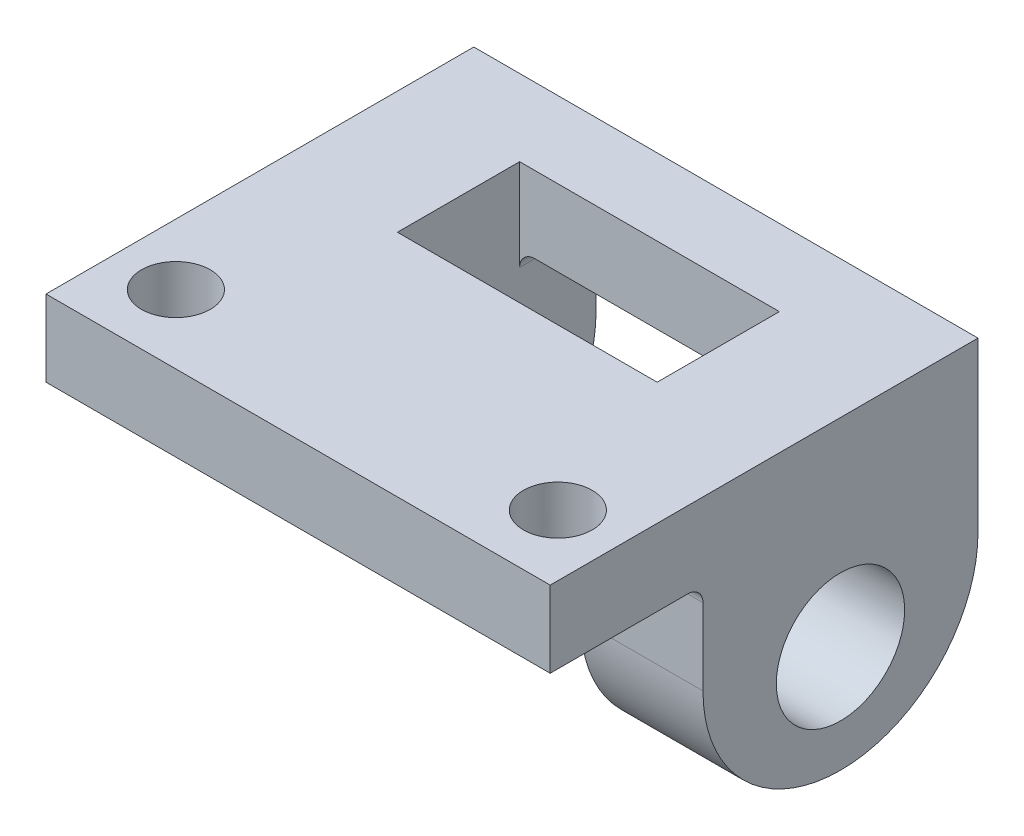
ISO-10303-21;
HEADER;
FILE_DESCRIPTION(('STEP AP214'),'2;1');
FILE_NAME('part.step','',(''),(''),'','','');
FILE_SCHEMA(('AUTOMOTIVE_DESIGN { 1 0 10303 214 1 1 1 1 }'));
ENDSEC;
DATA;
#1=APPLICATION_CONTEXT('core data for automotive mechanical design processes');
#2=APPLICATION_PROTOCOL_DEFINITION('international standard','automotive_design',2000,#1);
#3=PRODUCT_CONTEXT('',#1,'mechanical');
#4=PRODUCT('Part','Part','',(#3));
#5=PRODUCT_RELATED_PRODUCT_CATEGORY('part','',(#4));
#6=PRODUCT_DEFINITION_FORMATION('','',#4);
#7=PRODUCT_DEFINITION_CONTEXT('part definition',#1,'design');
#8=PRODUCT_DEFINITION('design','',#6,#7);
#9=PRODUCT_DEFINITION_SHAPE('','',#8);
#10=(LENGTH_UNIT() NAMED_UNIT(*) SI_UNIT(.MILLI.,.METRE.));
#11=(NAMED_UNIT(*) PLANE_ANGLE_UNIT() SI_UNIT($,.RADIAN.));
#12=(NAMED_UNIT(*) SI_UNIT($,.STERADIAN.) SOLID_ANGLE_UNIT());
#13=UNCERTAINTY_MEASURE_WITH_UNIT(LENGTH_MEASURE(1.E-05),#10,'distance_accuracy_value','');
#14=(GEOMETRIC_REPRESENTATION_CONTEXT(3) GLOBAL_UNCERTAINTY_ASSIGNED_CONTEXT((#13)) GLOBAL_UNIT_ASSIGNED_CONTEXT((#10,
#11,#12)) REPRESENTATION_CONTEXT('',''));
#15=CARTESIAN_POINT('',(0.,0.,0.));
#16=DIRECTION('',(0.,0.,1.));
#17=DIRECTION('',(1.,0.,0.));
#18=AXIS2_PLACEMENT_3D('',#15,#16,#17);
#19=CARTESIAN_POINT('',(0.,0.,0.));
#20=DIRECTION('',(0.,1.,0.));
#21=DIRECTION('',(0.,0.,1.));
#22=AXIS2_PLACEMENT_3D('',#19,#20,#21);
#23=PLANE('',#22);
#24=CARTESIAN_POINT('',(-12.5,0.,14.5));
#25=DIRECTION('',(0.,-1.,0.));
#26=DIRECTION('',(0.,0.,-1.));
#27=AXIS2_PLACEMENT_3D('',#24,#25,#26);
#28=CIRCLE('',#27,2.25);
#29=CARTESIAN_POINT('',(-12.5,0.,12.25));
#30=VERTEX_POINT('',#29);
#31=EDGE_CURVE('E337',#30,#30,#28,.T.);
#32=ORIENTED_EDGE('',*,*,#31,.F.);
#33=EDGE_LOOP('',(#32));
#34=FACE_BOUND('',#33,.T.);
#35=CARTESIAN_POINT('',(12.5,0.,14.5));
#36=DIRECTION('',(0.,-1.,0.));
#37=DIRECTION('',(0.,0.,-1.));
#38=AXIS2_PLACEMENT_3D('',#35,#36,#37);
#39=CIRCLE('',#38,2.25);
#40=CARTESIAN_POINT('',(12.5,0.,12.25));
#41=VERTEX_POINT('',#40);
#42=EDGE_CURVE('E342',#41,#41,#39,.T.);
#43=ORIENTED_EDGE('',*,*,#42,.F.);
#44=EDGE_LOOP('',(#43));
#45=FACE_BOUND('',#44,.T.);
#46=DIRECTION('',(0.,0.,1.));
#47=VECTOR('',#46,1.);
#48=CARTESIAN_POINT('',(-16.5,0.,-9.));
#49=LINE('',#48,#47);
#50=CARTESIAN_POINT('',(-16.5,0.,9.99999999999999));
#51=VERTEX_POINT('',#50);
#52=CARTESIAN_POINT('',(-16.5,0.,19.));
#53=VERTEX_POINT('',#52);
#54=EDGE_CURVE('E202',#51,#53,#49,.T.);
#55=ORIENTED_EDGE('',*,*,#54,.F.);
#56=DIRECTION('',(-1.,0.,0.));
#57=VECTOR('',#56,1.);
#58=CARTESIAN_POINT('',(-8.5,0.,10.));
#59=LINE('',#58,#57);
#60=CARTESIAN_POINT('',(-7.5,0.,10.));
#61=VERTEX_POINT('',#60);
#62=EDGE_CURVE('E58',#51,#61,#59,.F.);
#63=ORIENTED_EDGE('',*,*,#62,.T.);
#64=DIRECTION('',(0.,0.,1.));
#65=VECTOR('',#64,1.);
#66=CARTESIAN_POINT('',(-7.5,0.,0.));
#67=LINE('',#66,#65);
#68=CARTESIAN_POINT('',(-7.5,0.,4.));
#69=VERTEX_POINT('',#68);
#70=EDGE_CURVE('E313',#61,#69,#67,.F.);
#71=ORIENTED_EDGE('',*,*,#70,.T.);
#72=DIRECTION('',(1.,0.,0.));
#73=VECTOR('',#72,1.);
#74=CARTESIAN_POINT('',(-8.5,0.,4.));
#75=LINE('',#74,#73);
#76=CARTESIAN_POINT('',(7.50000000000001,0.,4.));
#77=VERTEX_POINT('',#76);
#78=EDGE_CURVE('E215',#69,#77,#75,.T.);
#79=ORIENTED_EDGE('',*,*,#78,.T.);
#80=DIRECTION('',(0.,0.,-1.));
#81=VECTOR('',#80,1.);
#82=CARTESIAN_POINT('',(7.5,0.,0.));
#83=LINE('',#82,#81);
#84=CARTESIAN_POINT('',(7.50000000000001,0.,10.));
#85=VERTEX_POINT('',#84);
#86=EDGE_CURVE('E311',#77,#85,#83,.F.);
#87=ORIENTED_EDGE('',*,*,#86,.T.);
#88=DIRECTION('',(-1.,0.,0.));
#89=VECTOR('',#88,1.);
#90=CARTESIAN_POINT('',(16.5,0.,10.));
#91=LINE('',#90,#89);
#92=CARTESIAN_POINT('',(16.5,0.,9.99999999999999));
#93=VERTEX_POINT('',#92);
#94=EDGE_CURVE('E309',#85,#93,#91,.F.);
#95=ORIENTED_EDGE('',*,*,#94,.T.);
#96=DIRECTION('',(0.,0.,-1.));
#97=VECTOR('',#96,1.);
#98=CARTESIAN_POINT('',(16.5,0.,-9.));
#99=LINE('',#98,#97);
#100=CARTESIAN_POINT('',(16.5,0.,19.));
#101=VERTEX_POINT('',#100);
#102=EDGE_CURVE('E239',#101,#93,#99,.T.);
#103=ORIENTED_EDGE('',*,*,#102,.F.);
#104=DIRECTION('',(1.,0.,0.));
#105=VECTOR('',#104,1.);
#106=CARTESIAN_POINT('',(-16.5,0.,19.));
#107=LINE('',#106,#105);
#108=EDGE_CURVE('E237',#53,#101,#107,.T.);
#109=ORIENTED_EDGE('',*,*,#108,.F.);
#110=EDGE_LOOP('',(#55,#63,#71,#79,#87,#95,#103,#109));
#111=FACE_BOUND('',#110,.T.);
#112=ADVANCED_FACE('F35',(#34,#45,#111),#23,.F.);
#113=DIRECTION('',(-1.,0.,0.));
#114=VECTOR('',#113,1.);
#115=CARTESIAN_POINT('',(-16.5,0.,-9.));
#116=LINE('',#115,#114);
#117=CARTESIAN_POINT('',(7.5,0.,-9.));
#118=VERTEX_POINT('',#117);
#119=CARTESIAN_POINT('',(-7.5,0.,-9.));
#120=VERTEX_POINT('',#119);
#121=EDGE_CURVE('E229',#118,#120,#116,.T.);
#122=ORIENTED_EDGE('',*,*,#121,.F.);
#123=DIRECTION('',(0.,0.,-1.));
#124=VECTOR('',#123,1.);
#125=CARTESIAN_POINT('',(7.5,0.,0.));
#126=LINE('',#125,#124);
#127=CARTESIAN_POINT('',(7.5,0.,-4.));
#128=VERTEX_POINT('',#127);
#129=EDGE_CURVE('E300',#118,#128,#126,.F.);
#130=ORIENTED_EDGE('',*,*,#129,.T.);
#131=DIRECTION('',(-1.,0.,0.));
#132=VECTOR('',#131,1.);
#133=CARTESIAN_POINT('',(-8.5,0.,-4.));
#134=LINE('',#133,#132);
#135=CARTESIAN_POINT('',(-7.5,0.,-4.));
#136=VERTEX_POINT('',#135);
#137=EDGE_CURVE('E193',#128,#136,#134,.T.);
#138=ORIENTED_EDGE('',*,*,#137,.T.);
#139=DIRECTION('',(0.,0.,1.));
#140=VECTOR('',#139,1.);
#141=CARTESIAN_POINT('',(-7.5,0.,0.));
#142=LINE('',#141,#140);
#143=EDGE_CURVE('E298',#136,#120,#142,.F.);
#144=ORIENTED_EDGE('',*,*,#143,.T.);
#145=EDGE_LOOP('',(#122,#130,#138,#144));
#146=FACE_BOUND('',#145,.T.);
#147=ADVANCED_FACE('F385',(#146),#23,.F.);
#148=CARTESIAN_POINT('',(0.,5.,0.));
#149=DIRECTION('',(0.,1.,0.));
#150=DIRECTION('',(0.,0.,1.));
#151=AXIS2_PLACEMENT_3D('',#148,#149,#150);
#152=PLANE('',#151);
#153=CARTESIAN_POINT('',(-12.5,5.,14.5));
#154=DIRECTION('',(0.,1.,0.));
#155=DIRECTION('',(0.,0.,1.));
#156=AXIS2_PLACEMENT_3D('',#153,#154,#155);
#157=CIRCLE('',#156,2.25);
#158=CARTESIAN_POINT('',(-12.5,5.,16.75));
#159=VERTEX_POINT('',#158);
#160=EDGE_CURVE('E39',#159,#159,#157,.T.);
#161=ORIENTED_EDGE('',*,*,#160,.F.);
#162=EDGE_LOOP('',(#161));
#163=FACE_BOUND('',#162,.T.);
#164=CARTESIAN_POINT('',(12.5,5.,14.5));
#165=DIRECTION('',(0.,1.,0.));
#166=DIRECTION('',(0.,0.,1.));
#167=AXIS2_PLACEMENT_3D('',#164,#165,#166);
#168=CIRCLE('',#167,2.25);
#169=CARTESIAN_POINT('',(12.5,5.,16.75));
#170=VERTEX_POINT('',#169);
#171=EDGE_CURVE('E335',#170,#170,#168,.T.);
#172=ORIENTED_EDGE('',*,*,#171,.F.);
#173=EDGE_LOOP('',(#172));
#174=FACE_BOUND('',#173,.T.);
#175=DIRECTION('',(0.,0.,1.));
#176=VECTOR('',#175,1.);
#177=CARTESIAN_POINT('',(-16.5,5.,-9.));
#178=LINE('',#177,#176);
#179=CARTESIAN_POINT('',(-16.5,5.,-9.));
#180=VERTEX_POINT('',#179);
#181=CARTESIAN_POINT('',(-16.5,5.,19.));
#182=VERTEX_POINT('',#181);
#183=EDGE_CURVE('E225',#180,#182,#178,.T.);
#184=ORIENTED_EDGE('',*,*,#183,.T.);
#185=DIRECTION('',(1.,0.,0.));
#186=VECTOR('',#185,1.);
#187=CARTESIAN_POINT('',(-16.5,5.,19.));
#188=LINE('',#187,#186);
#189=CARTESIAN_POINT('',(16.5,5.,19.));
#190=VERTEX_POINT('',#189);
#191=EDGE_CURVE('E228',#182,#190,#188,.T.);
#192=ORIENTED_EDGE('',*,*,#191,.T.);
#193=DIRECTION('',(0.,0.,-1.));
#194=VECTOR('',#193,1.);
#195=CARTESIAN_POINT('',(16.5,5.,-9.));
#196=LINE('',#195,#194);
#197=CARTESIAN_POINT('',(16.5,5.,-9.));
#198=VERTEX_POINT('',#197);
#199=EDGE_CURVE('E231',#190,#198,#196,.T.);
#200=ORIENTED_EDGE('',*,*,#199,.T.);
#201=DIRECTION('',(-1.,0.,0.));
#202=VECTOR('',#201,1.);
#203=CARTESIAN_POINT('',(-16.5,5.,-9.));
#204=LINE('',#203,#202);
#205=EDGE_CURVE('E233',#198,#180,#204,.T.);
#206=ORIENTED_EDGE('',*,*,#205,.T.);
#207=EDGE_LOOP('',(#184,#192,#200,#206));
#208=FACE_BOUND('',#207,.T.);
#209=DIRECTION('',(1.,0.,0.));
#210=VECTOR('',#209,1.);
#211=CARTESIAN_POINT('',(-8.5,5.,4.));
#212=LINE('',#211,#210);
#213=CARTESIAN_POINT('',(-8.5,5.,4.));
#214=VERTEX_POINT('',#213);
#215=CARTESIAN_POINT('',(8.5,5.,4.));
#216=VERTEX_POINT('',#215);
#217=EDGE_CURVE('E192',#214,#216,#212,.T.);
#218=ORIENTED_EDGE('',*,*,#217,.F.);
#219=DIRECTION('',(0.,0.,1.));
#220=VECTOR('',#219,1.);
#221=CARTESIAN_POINT('',(-8.5,5.,-4.));
#222=LINE('',#221,#220);
#223=CARTESIAN_POINT('',(-8.5,5.,-4.));
#224=VERTEX_POINT('',#223);
#225=EDGE_CURVE('E181',#224,#214,#222,.T.);
#226=ORIENTED_EDGE('',*,*,#225,.F.);
#227=DIRECTION('',(-1.,0.,0.));
#228=VECTOR('',#227,1.);
#229=CARTESIAN_POINT('',(-8.5,5.,-4.));
#230=LINE('',#229,#228);
#231=CARTESIAN_POINT('',(8.5,5.,-4.));
#232=VERTEX_POINT('',#231);
#233=EDGE_CURVE('E210',#232,#224,#230,.T.);
#234=ORIENTED_EDGE('',*,*,#233,.F.);
#235=DIRECTION('',(0.,0.,-1.));
#236=VECTOR('',#235,1.);
#237=CARTESIAN_POINT('',(8.5,5.,-4.));
#238=LINE('',#237,#236);
#239=EDGE_CURVE('E208',#216,#232,#238,.T.);
#240=ORIENTED_EDGE('',*,*,#239,.F.);
#241=EDGE_LOOP('',(#218,#226,#234,#240));
#242=FACE_BOUND('',#241,.T.);
#243=ADVANCED_FACE('F206',(#163,#174,#208,#242),#152,.T.);
#244=CARTESIAN_POINT('',(-16.5,5.,-9.));
#245=DIRECTION('',(1.,0.,0.));
#246=DIRECTION('',(0.,0.,-1.));
#247=AXIS2_PLACEMENT_3D('',#244,#245,#246);
#248=PLANE('',#247);
#249=CARTESIAN_POINT('',(-16.5,-8.,0.));
#250=DIRECTION('',(-1.,0.,0.));
#251=DIRECTION('',(0.,0.,1.));
#252=AXIS2_PLACEMENT_3D('',#249,#250,#251);
#253=CIRCLE('',#252,4.2);
#254=CARTESIAN_POINT('',(-16.5,-8.,4.2));
#255=VERTEX_POINT('',#254);
#256=EDGE_CURVE('E259',#255,#255,#253,.T.);
#257=ORIENTED_EDGE('',*,*,#256,.F.);
#258=EDGE_LOOP('',(#257));
#259=FACE_BOUND('',#258,.T.);
#260=CARTESIAN_POINT('',(-16.5,-6.,0.));
#261=DIRECTION('',(1.,0.,0.));
#262=DIRECTION('',(0.,0.,-1.));
#263=AXIS2_PLACEMENT_3D('',#260,#261,#262);
#264=CIRCLE('',#263,9.);
#265=CARTESIAN_POINT('',(-16.5,-6.,-9.));
#266=VERTEX_POINT('',#265);
#267=CARTESIAN_POINT('',(-16.5,-15.,0.));
#268=VERTEX_POINT('',#267);
#269=EDGE_CURVE('E274',#266,#268,#264,.F.);
#270=ORIENTED_EDGE('',*,*,#269,.T.);
#271=CARTESIAN_POINT('',(-16.5,-6.,0.));
#272=DIRECTION('',(1.,0.,0.));
#273=DIRECTION('',(0.,0.,-1.));
#274=AXIS2_PLACEMENT_3D('',#271,#272,#273);
#275=CIRCLE('',#274,9.);
#276=CARTESIAN_POINT('',(-16.5,-6.,9.));
#277=VERTEX_POINT('',#276);
#278=EDGE_CURVE('E276',#268,#277,#275,.F.);
#279=ORIENTED_EDGE('',*,*,#278,.T.);
#280=DIRECTION('',(0.,1.,0.));
#281=VECTOR('',#280,1.);
#282=CARTESIAN_POINT('',(-16.5,-15.,9.));
#283=LINE('',#282,#281);
#284=CARTESIAN_POINT('',(-16.5,-1.,9.));
#285=VERTEX_POINT('',#284);
#286=EDGE_CURVE('E364',#277,#285,#283,.T.);
#287=ORIENTED_EDGE('',*,*,#286,.T.);
#288=CARTESIAN_POINT('',(-16.5,-1.,10.));
#289=DIRECTION('',(1.,0.,0.));
#290=DIRECTION('',(0.,0.,-1.));
#291=AXIS2_PLACEMENT_3D('',#288,#289,#290);
#292=CIRCLE('',#291,1.);
#293=EDGE_CURVE('E327',#285,#51,#292,.T.);
#294=ORIENTED_EDGE('',*,*,#293,.T.);
#295=ORIENTED_EDGE('',*,*,#54,.T.);
#296=DIRECTION('',(0.,-1.,0.));
#297=VECTOR('',#296,1.);
#298=CARTESIAN_POINT('',(-16.5,5.,19.));
#299=LINE('',#298,#297);
#300=EDGE_CURVE('E251',#182,#53,#299,.T.);
#301=ORIENTED_EDGE('',*,*,#300,.F.);
#302=ORIENTED_EDGE('',*,*,#183,.F.);
#303=DIRECTION('',(0.,-1.,0.));
#304=VECTOR('',#303,1.);
#305=CARTESIAN_POINT('',(-16.5,5.,-9.));
#306=LINE('',#305,#304);
#307=EDGE_CURVE('E235',#180,#266,#306,.T.);
#308=ORIENTED_EDGE('',*,*,#307,.T.);
#309=EDGE_LOOP('',(#270,#279,#287,#294,#295,#301,#302,#308));
#310=FACE_BOUND('',#309,.T.);
#311=ADVANCED_FACE('F430',(#259,#310),#248,.F.);
#312=CARTESIAN_POINT('',(-16.5,5.,19.));
#313=DIRECTION('',(0.,0.,-1.));
#314=DIRECTION('',(-1.,0.,0.));
#315=AXIS2_PLACEMENT_3D('',#312,#313,#314);
#316=PLANE('',#315);
#317=ORIENTED_EDGE('',*,*,#108,.T.);
#318=DIRECTION('',(0.,-1.,0.));
#319=VECTOR('',#318,1.);
#320=CARTESIAN_POINT('',(16.5,5.,19.));
#321=LINE('',#320,#319);
#322=EDGE_CURVE('E248',#190,#101,#321,.T.);
#323=ORIENTED_EDGE('',*,*,#322,.F.);
#324=ORIENTED_EDGE('',*,*,#191,.F.);
#325=ORIENTED_EDGE('',*,*,#300,.T.);
#326=EDGE_LOOP('',(#317,#323,#324,#325));
#327=FACE_BOUND('',#326,.T.);
#328=ADVANCED_FACE('F428',(#327),#316,.F.);
#329=CARTESIAN_POINT('',(16.5,5.,-9.));
#330=DIRECTION('',(-1.,0.,0.));
#331=DIRECTION('',(0.,0.,1.));
#332=AXIS2_PLACEMENT_3D('',#329,#330,#331);
#333=PLANE('',#332);
#334=CARTESIAN_POINT('',(16.5,-8.,0.));
#335=DIRECTION('',(-1.,0.,0.));
#336=DIRECTION('',(0.,0.,1.));
#337=AXIS2_PLACEMENT_3D('',#334,#335,#336);
#338=CIRCLE('',#337,4.2);
#339=CARTESIAN_POINT('',(16.5,-8.,4.2));
#340=VERTEX_POINT('',#339);
#341=EDGE_CURVE('E353',#340,#340,#338,.T.);
#342=ORIENTED_EDGE('',*,*,#341,.T.);
#343=EDGE_LOOP('',(#342));
#344=FACE_BOUND('',#343,.T.);
#345=CARTESIAN_POINT('',(16.5,-6.,0.));
#346=DIRECTION('',(-1.,0.,0.));
#347=DIRECTION('',(0.,0.,1.));
#348=AXIS2_PLACEMENT_3D('',#345,#346,#347);
#349=CIRCLE('',#348,9.);
#350=CARTESIAN_POINT('',(16.5,-6.,9.));
#351=VERTEX_POINT('',#350);
#352=CARTESIAN_POINT('',(16.5,-15.,0.));
#353=VERTEX_POINT('',#352);
#354=EDGE_CURVE('E254',#351,#353,#349,.F.);
#355=ORIENTED_EDGE('',*,*,#354,.T.);
#356=CARTESIAN_POINT('',(16.5,-6.,0.));
#357=DIRECTION('',(-1.,0.,0.));
#358=DIRECTION('',(0.,0.,1.));
#359=AXIS2_PLACEMENT_3D('',#356,#357,#358);
#360=CIRCLE('',#359,9.);
#361=CARTESIAN_POINT('',(16.5,-6.,-9.));
#362=VERTEX_POINT('',#361);
#363=EDGE_CURVE('E261',#353,#362,#360,.F.);
#364=ORIENTED_EDGE('',*,*,#363,.T.);
#365=DIRECTION('',(0.,-1.,0.));
#366=VECTOR('',#365,1.);
#367=CARTESIAN_POINT('',(16.5,5.,-9.));
#368=LINE('',#367,#366);
#369=EDGE_CURVE('E245',#198,#362,#368,.T.);
#370=ORIENTED_EDGE('',*,*,#369,.F.);
#371=ORIENTED_EDGE('',*,*,#199,.F.);
#372=ORIENTED_EDGE('',*,*,#322,.T.);
#373=ORIENTED_EDGE('',*,*,#102,.T.);
#374=CARTESIAN_POINT('',(16.5,-1.,10.));
#375=DIRECTION('',(-1.,0.,0.));
#376=DIRECTION('',(0.,0.,1.));
#377=AXIS2_PLACEMENT_3D('',#374,#375,#376);
#378=CIRCLE('',#377,1.);
#379=CARTESIAN_POINT('',(16.5,-1.,9.));
#380=VERTEX_POINT('',#379);
#381=EDGE_CURVE('E11',#93,#380,#378,.T.);
#382=ORIENTED_EDGE('',*,*,#381,.T.);
#383=DIRECTION('',(0.,1.,0.));
#384=VECTOR('',#383,1.);
#385=CARTESIAN_POINT('',(16.5,-15.,9.));
#386=LINE('',#385,#384);
#387=EDGE_CURVE('E362',#351,#380,#386,.T.);
#388=ORIENTED_EDGE('',*,*,#387,.F.);
#389=EDGE_LOOP('',(#355,#364,#370,#371,#372,#373,#382,#388));
#390=FACE_BOUND('',#389,.T.);
#391=ADVANCED_FACE('F417',(#344,#390),#333,.F.);
#392=CARTESIAN_POINT('',(-16.5,5.,-9.));
#393=DIRECTION('',(0.,0.,1.));
#394=DIRECTION('',(1.,0.,0.));
#395=AXIS2_PLACEMENT_3D('',#392,#393,#394);
#396=PLANE('',#395);
#397=ORIENTED_EDGE('',*,*,#369,.T.);
#398=DIRECTION('',(1.,0.,0.));
#399=VECTOR('',#398,1.);
#400=CARTESIAN_POINT('',(-16.5,-6.,-9.));
#401=LINE('',#400,#399);
#402=CARTESIAN_POINT('',(8.50000000000001,-6.,-9.));
#403=VERTEX_POINT('',#402);
#404=EDGE_CURVE('E265',#362,#403,#401,.F.);
#405=ORIENTED_EDGE('',*,*,#404,.T.);
#406=DIRECTION('',(0.,1.,0.));
#407=VECTOR('',#406,1.);
#408=CARTESIAN_POINT('',(8.50000000000001,-15.,-9.));
#409=LINE('',#408,#407);
#410=CARTESIAN_POINT('',(8.50000000000001,-1.,-9.));
#411=VERTEX_POINT('',#410);
#412=EDGE_CURVE('E356',#403,#411,#409,.T.);
#413=ORIENTED_EDGE('',*,*,#412,.T.);
#414=CARTESIAN_POINT('',(7.5,-1.,-9.));
#415=DIRECTION('',(0.,0.,1.));
#416=DIRECTION('',(1.,0.,0.));
#417=AXIS2_PLACEMENT_3D('',#414,#415,#416);
#418=CIRCLE('',#417,1.);
#419=EDGE_CURVE('E318',#411,#118,#418,.T.);
#420=ORIENTED_EDGE('',*,*,#419,.T.);
#421=ORIENTED_EDGE('',*,*,#121,.T.);
#422=CARTESIAN_POINT('',(-7.5,-1.,-9.));
#423=DIRECTION('',(0.,0.,1.));
#424=DIRECTION('',(1.,0.,0.));
#425=AXIS2_PLACEMENT_3D('',#422,#423,#424);
#426=CIRCLE('',#425,1.);
#427=CARTESIAN_POINT('',(-8.5,-1.,-9.));
#428=VERTEX_POINT('',#427);
#429=EDGE_CURVE('E325',#120,#428,#426,.T.);
#430=ORIENTED_EDGE('',*,*,#429,.T.);
#431=DIRECTION('',(0.,1.,0.));
#432=VECTOR('',#431,1.);
#433=CARTESIAN_POINT('',(-8.5,-15.,-9.));
#434=LINE('',#433,#432);
#435=CARTESIAN_POINT('',(-8.5,-6.,-9.));
#436=VERTEX_POINT('',#435);
#437=EDGE_CURVE('E218',#436,#428,#434,.T.);
#438=ORIENTED_EDGE('',*,*,#437,.F.);
#439=DIRECTION('',(1.,0.,0.));
#440=VECTOR('',#439,1.);
#441=CARTESIAN_POINT('',(-16.5,-6.,-9.));
#442=LINE('',#441,#440);
#443=EDGE_CURVE('E263',#436,#266,#442,.F.);
#444=ORIENTED_EDGE('',*,*,#443,.T.);
#445=ORIENTED_EDGE('',*,*,#307,.F.);
#446=ORIENTED_EDGE('',*,*,#205,.F.);
#447=EDGE_LOOP('',(#397,#405,#413,#420,#421,#430,#438,#444,#445,#446));
#448=FACE_BOUND('',#447,.T.);
#449=ADVANCED_FACE('F420',(#448),#396,.F.);
#450=CARTESIAN_POINT('',(-8.5,5.,-4.));
#451=DIRECTION('',(1.,0.,0.));
#452=DIRECTION('',(0.,0.,-1.));
#453=AXIS2_PLACEMENT_3D('',#450,#451,#452);
#454=PLANE('',#453);
#455=CARTESIAN_POINT('',(-8.5,-8.,0.));
#456=DIRECTION('',(1.,0.,0.));
#457=DIRECTION('',(0.,0.,-1.));
#458=AXIS2_PLACEMENT_3D('',#455,#456,#457);
#459=CIRCLE('',#458,4.2);
#460=CARTESIAN_POINT('',(-8.5,-8.,-4.2));
#461=VERTEX_POINT('',#460);
#462=EDGE_CURVE('E258',#461,#461,#459,.T.);
#463=ORIENTED_EDGE('',*,*,#462,.F.);
#464=EDGE_LOOP('',(#463));
#465=FACE_BOUND('',#464,.T.);
#466=ORIENTED_EDGE('',*,*,#437,.T.);
#467=DIRECTION('',(0.,0.,1.));
#468=VECTOR('',#467,1.);
#469=CARTESIAN_POINT('',(-8.5,-1.,-4.));
#470=LINE('',#469,#468);
#471=CARTESIAN_POINT('',(-8.5,-1.,-4.));
#472=VERTEX_POINT('',#471);
#473=EDGE_CURVE('E304',#428,#472,#470,.T.);
#474=ORIENTED_EDGE('',*,*,#473,.T.);
#475=DIRECTION('',(0.,-1.,0.));
#476=VECTOR('',#475,1.);
#477=CARTESIAN_POINT('',(-8.5,5.,-4.));
#478=LINE('',#477,#476);
#479=EDGE_CURVE('E188',#224,#472,#478,.T.);
#480=ORIENTED_EDGE('',*,*,#479,.F.);
#481=ORIENTED_EDGE('',*,*,#225,.T.);
#482=DIRECTION('',(0.,-1.,0.));
#483=VECTOR('',#482,1.);
#484=CARTESIAN_POINT('',(-8.5,5.,4.));
#485=LINE('',#484,#483);
#486=CARTESIAN_POINT('',(-8.5,-1.,4.));
#487=VERTEX_POINT('',#486);
#488=EDGE_CURVE('E185',#214,#487,#485,.T.);
#489=ORIENTED_EDGE('',*,*,#488,.T.);
#490=DIRECTION('',(0.,0.,1.));
#491=VECTOR('',#490,1.);
#492=CARTESIAN_POINT('',(-8.5,-1.,-4.));
#493=LINE('',#492,#491);
#494=CARTESIAN_POINT('',(-8.5,-1.,9.));
#495=VERTEX_POINT('',#494);
#496=EDGE_CURVE('E302',#487,#495,#493,.T.);
#497=ORIENTED_EDGE('',*,*,#496,.T.);
#498=DIRECTION('',(0.,1.,0.));
#499=VECTOR('',#498,1.);
#500=CARTESIAN_POINT('',(-8.5,-15.,9.));
#501=LINE('',#500,#499);
#502=CARTESIAN_POINT('',(-8.5,-6.,9.));
#503=VERTEX_POINT('',#502);
#504=EDGE_CURVE('E367',#503,#495,#501,.T.);
#505=ORIENTED_EDGE('',*,*,#504,.F.);
#506=CARTESIAN_POINT('',(-8.5,-6.,0.));
#507=DIRECTION('',(1.,0.,0.));
#508=DIRECTION('',(0.,0.,-1.));
#509=AXIS2_PLACEMENT_3D('',#506,#507,#508);
#510=CIRCLE('',#509,9.);
#511=CARTESIAN_POINT('',(-8.5,-15.,0.));
#512=VERTEX_POINT('',#511);
#513=EDGE_CURVE('E283',#503,#512,#510,.T.);
#514=ORIENTED_EDGE('',*,*,#513,.T.);
#515=CARTESIAN_POINT('',(-8.5,-6.,0.));
#516=DIRECTION('',(1.,0.,0.));
#517=DIRECTION('',(0.,0.,-1.));
#518=AXIS2_PLACEMENT_3D('',#515,#516,#517);
#519=CIRCLE('',#518,9.);
#520=EDGE_CURVE('E281',#512,#436,#519,.T.);
#521=ORIENTED_EDGE('',*,*,#520,.T.);
#522=EDGE_LOOP('',(#466,#474,#480,#481,#489,#497,#505,#514,#521));
#523=FACE_BOUND('',#522,.T.);
#524=ADVANCED_FACE('F184',(#465,#523),#454,.T.);
#525=CARTESIAN_POINT('',(-8.5,5.,4.));
#526=DIRECTION('',(0.,0.,-1.));
#527=DIRECTION('',(-1.,0.,0.));
#528=AXIS2_PLACEMENT_3D('',#525,#526,#527);
#529=PLANE('',#528);
#530=ORIENTED_EDGE('',*,*,#78,.F.);
#531=CARTESIAN_POINT('',(-7.5,-1.,4.));
#532=DIRECTION('',(0.,0.,-1.));
#533=DIRECTION('',(-1.,0.,0.));
#534=AXIS2_PLACEMENT_3D('',#531,#532,#533);
#535=CIRCLE('',#534,1.);
#536=EDGE_CURVE('E200',#69,#487,#535,.F.);
#537=ORIENTED_EDGE('',*,*,#536,.T.);
#538=ORIENTED_EDGE('',*,*,#488,.F.);
#539=ORIENTED_EDGE('',*,*,#217,.T.);
#540=DIRECTION('',(0.,-1.,0.));
#541=VECTOR('',#540,1.);
#542=CARTESIAN_POINT('',(8.5,5.,4.));
#543=LINE('',#542,#541);
#544=CARTESIAN_POINT('',(8.5,-1.,4.));
#545=VERTEX_POINT('',#544);
#546=EDGE_CURVE('E203',#216,#545,#543,.T.);
#547=ORIENTED_EDGE('',*,*,#546,.T.);
#548=CARTESIAN_POINT('',(7.5,-1.,4.));
#549=DIRECTION('',(0.,0.,-1.));
#550=DIRECTION('',(-1.,0.,0.));
#551=AXIS2_PLACEMENT_3D('',#548,#549,#550);
#552=CIRCLE('',#551,1.);
#553=EDGE_CURVE('E44',#545,#77,#552,.F.);
#554=ORIENTED_EDGE('',*,*,#553,.T.);
#555=EDGE_LOOP('',(#530,#537,#538,#539,#547,#554));
#556=FACE_BOUND('',#555,.T.);
#557=ADVANCED_FACE('F197',(#556),#529,.T.);
#558=CARTESIAN_POINT('',(8.5,5.,-4.));
#559=DIRECTION('',(-1.,0.,0.));
#560=DIRECTION('',(0.,0.,1.));
#561=AXIS2_PLACEMENT_3D('',#558,#559,#560);
#562=PLANE('',#561);
#563=CARTESIAN_POINT('',(8.5,-8.,0.));
#564=DIRECTION('',(-1.,0.,0.));
#565=DIRECTION('',(0.,0.,1.));
#566=AXIS2_PLACEMENT_3D('',#563,#564,#565);
#567=CIRCLE('',#566,4.2);
#568=CARTESIAN_POINT('',(8.5,-8.,4.2));
#569=VERTEX_POINT('',#568);
#570=EDGE_CURVE('E255',#569,#569,#567,.T.);
#571=ORIENTED_EDGE('',*,*,#570,.F.);
#572=EDGE_LOOP('',(#571));
#573=FACE_BOUND('',#572,.T.);
#574=DIRECTION('',(0.,-1.,0.));
#575=VECTOR('',#574,1.);
#576=CARTESIAN_POINT('',(8.5,5.,-4.));
#577=LINE('',#576,#575);
#578=CARTESIAN_POINT('',(8.5,-1.,-4.));
#579=VERTEX_POINT('',#578);
#580=EDGE_CURVE('E222',#232,#579,#577,.T.);
#581=ORIENTED_EDGE('',*,*,#580,.T.);
#582=DIRECTION('',(0.,0.,-1.));
#583=VECTOR('',#582,1.);
#584=CARTESIAN_POINT('',(8.5,-1.,-4.));
#585=LINE('',#584,#583);
#586=EDGE_CURVE('E295',#579,#411,#585,.T.);
#587=ORIENTED_EDGE('',*,*,#586,.T.);
#588=ORIENTED_EDGE('',*,*,#412,.F.);
#589=CARTESIAN_POINT('',(8.5,-6.,0.));
#590=DIRECTION('',(-1.,0.,0.));
#591=DIRECTION('',(0.,0.,1.));
#592=AXIS2_PLACEMENT_3D('',#589,#590,#591);
#593=CIRCLE('',#592,9.);
#594=CARTESIAN_POINT('',(8.50000000000001,-15.,0.));
#595=VERTEX_POINT('',#594);
#596=EDGE_CURVE('E270',#403,#595,#593,.T.);
#597=ORIENTED_EDGE('',*,*,#596,.T.);
#598=CARTESIAN_POINT('',(8.5,-6.,0.));
#599=DIRECTION('',(-1.,0.,0.));
#600=DIRECTION('',(0.,0.,1.));
#601=AXIS2_PLACEMENT_3D('',#598,#599,#600);
#602=CIRCLE('',#601,9.);
#603=CARTESIAN_POINT('',(8.5,-6.,9.));
#604=VERTEX_POINT('',#603);
#605=EDGE_CURVE('E268',#595,#604,#602,.T.);
#606=ORIENTED_EDGE('',*,*,#605,.T.);
#607=DIRECTION('',(0.,1.,0.));
#608=VECTOR('',#607,1.);
#609=CARTESIAN_POINT('',(8.5,-15.,9.));
#610=LINE('',#609,#608);
#611=CARTESIAN_POINT('',(8.5,-1.,9.));
#612=VERTEX_POINT('',#611);
#613=EDGE_CURVE('E359',#604,#612,#610,.T.);
#614=ORIENTED_EDGE('',*,*,#613,.T.);
#615=DIRECTION('',(0.,0.,-1.));
#616=VECTOR('',#615,1.);
#617=CARTESIAN_POINT('',(8.5,-1.,-4.));
#618=LINE('',#617,#616);
#619=EDGE_CURVE('E285',#612,#545,#618,.T.);
#620=ORIENTED_EDGE('',*,*,#619,.T.);
#621=ORIENTED_EDGE('',*,*,#546,.F.);
#622=ORIENTED_EDGE('',*,*,#239,.T.);
#623=EDGE_LOOP('',(#581,#587,#588,#597,#606,#614,#620,#621,#622));
#624=FACE_BOUND('',#623,.T.);
#625=ADVANCED_FACE('F391',(#573,#624),#562,.T.);
#626=CARTESIAN_POINT('',(-8.5,5.,-4.));
#627=DIRECTION('',(0.,0.,1.));
#628=DIRECTION('',(1.,0.,0.));
#629=AXIS2_PLACEMENT_3D('',#626,#627,#628);
#630=PLANE('',#629);
#631=ORIENTED_EDGE('',*,*,#137,.F.);
#632=CARTESIAN_POINT('',(7.5,-1.,-4.));
#633=DIRECTION('',(0.,0.,1.));
#634=DIRECTION('',(1.,0.,0.));
#635=AXIS2_PLACEMENT_3D('',#632,#633,#634);
#636=CIRCLE('',#635,1.);
#637=EDGE_CURVE('E320',#128,#579,#636,.F.);
#638=ORIENTED_EDGE('',*,*,#637,.T.);
#639=ORIENTED_EDGE('',*,*,#580,.F.);
#640=ORIENTED_EDGE('',*,*,#233,.T.);
#641=ORIENTED_EDGE('',*,*,#479,.T.);
#642=CARTESIAN_POINT('',(-7.5,-1.,-4.));
#643=DIRECTION('',(0.,0.,1.));
#644=DIRECTION('',(1.,0.,0.));
#645=AXIS2_PLACEMENT_3D('',#642,#643,#644);
#646=CIRCLE('',#645,1.);
#647=EDGE_CURVE('E323',#472,#136,#646,.F.);
#648=ORIENTED_EDGE('',*,*,#647,.T.);
#649=EDGE_LOOP('',(#631,#638,#639,#640,#641,#648));
#650=FACE_BOUND('',#649,.T.);
#651=ADVANCED_FACE('F381',(#650),#630,.T.);
#652=CARTESIAN_POINT('',(-16.5,-15.,9.));
#653=DIRECTION('',(0.,0.,-1.));
#654=DIRECTION('',(-1.,0.,0.));
#655=AXIS2_PLACEMENT_3D('',#652,#653,#654);
#656=PLANE('',#655);
#657=ORIENTED_EDGE('',*,*,#504,.T.);
#658=DIRECTION('',(-1.,0.,0.));
#659=VECTOR('',#658,1.);
#660=CARTESIAN_POINT('',(-16.5,-1.,9.));
#661=LINE('',#660,#659);
#662=EDGE_CURVE('E306',#495,#285,#661,.T.);
#663=ORIENTED_EDGE('',*,*,#662,.T.);
#664=ORIENTED_EDGE('',*,*,#286,.F.);
#665=DIRECTION('',(-1.,0.,0.));
#666=VECTOR('',#665,1.);
#667=CARTESIAN_POINT('',(-8.5,-6.,9.));
#668=LINE('',#667,#666);
#669=EDGE_CURVE('E278',#277,#503,#668,.F.);
#670=ORIENTED_EDGE('',*,*,#669,.T.);
#671=EDGE_LOOP('',(#657,#663,#664,#670));
#672=FACE_BOUND('',#671,.T.);
#673=ADVANCED_FACE('F436',(#672),#656,.F.);
#674=CARTESIAN_POINT('',(16.5,-15.,9.));
#675=DIRECTION('',(0.,0.,-1.));
#676=DIRECTION('',(-1.,0.,0.));
#677=AXIS2_PLACEMENT_3D('',#674,#675,#676);
#678=PLANE('',#677);
#679=ORIENTED_EDGE('',*,*,#387,.T.);
#680=DIRECTION('',(-1.,0.,0.));
#681=VECTOR('',#680,1.);
#682=CARTESIAN_POINT('',(8.5,-1.,9.));
#683=LINE('',#682,#681);
#684=EDGE_CURVE('E316',#380,#612,#683,.T.);
#685=ORIENTED_EDGE('',*,*,#684,.T.);
#686=ORIENTED_EDGE('',*,*,#613,.F.);
#687=DIRECTION('',(-1.,0.,0.));
#688=VECTOR('',#687,1.);
#689=CARTESIAN_POINT('',(16.5,-6.,9.));
#690=LINE('',#689,#688);
#691=EDGE_CURVE('E272',#604,#351,#690,.F.);
#692=ORIENTED_EDGE('',*,*,#691,.T.);
#693=EDGE_LOOP('',(#679,#685,#686,#692));
#694=FACE_BOUND('',#693,.T.);
#695=ADVANCED_FACE('F404',(#694),#678,.F.);
#696=CARTESIAN_POINT('',(20.5,-8.,0.));
#697=DIRECTION('',(-1.,0.,0.));
#698=DIRECTION('',(0.,0.,1.));
#699=AXIS2_PLACEMENT_3D('',#696,#697,#698);
#700=CYLINDRICAL_SURFACE('',#699,4.2);
#701=ORIENTED_EDGE('',*,*,#570,.T.);
#702=EDGE_LOOP('',(#701));
#703=FACE_BOUND('',#702,.T.);
#704=ORIENTED_EDGE('',*,*,#341,.F.);
#705=EDGE_LOOP('',(#704));
#706=FACE_BOUND('',#705,.T.);
#707=ADVANCED_FACE('F556',(#703,#706),#700,.F.);
#708=ORIENTED_EDGE('',*,*,#462,.T.);
#709=EDGE_LOOP('',(#708));
#710=FACE_BOUND('',#709,.T.);
#711=ORIENTED_EDGE('',*,*,#256,.T.);
#712=EDGE_LOOP('',(#711));
#713=FACE_BOUND('',#712,.T.);
#714=ADVANCED_FACE('F475',(#710,#713),#700,.F.);
#715=CARTESIAN_POINT('',(0.,-6.,0.));
#716=DIRECTION('',(-1.,0.,0.));
#717=DIRECTION('',(0.,0.,1.));
#718=AXIS2_PLACEMENT_3D('',#715,#716,#717);
#719=CYLINDRICAL_SURFACE('',#718,9.);
#720=ORIENTED_EDGE('',*,*,#691,.F.);
#721=ORIENTED_EDGE('',*,*,#605,.F.);
#722=DIRECTION('',(-1.,0.,0.));
#723=VECTOR('',#722,1.);
#724=CARTESIAN_POINT('',(0.,-15.,0.));
#725=LINE('',#724,#723);
#726=EDGE_CURVE('E286',#353,#595,#725,.T.);
#727=ORIENTED_EDGE('',*,*,#726,.F.);
#728=ORIENTED_EDGE('',*,*,#354,.F.);
#729=EDGE_LOOP('',(#720,#721,#727,#728));
#730=FACE_BOUND('',#729,.T.);
#731=ADVANCED_FACE('F410',(#730),#719,.T.);
#732=CARTESIAN_POINT('',(0.,-6.,0.));
#733=DIRECTION('',(1.,0.,0.));
#734=DIRECTION('',(0.,0.,-1.));
#735=AXIS2_PLACEMENT_3D('',#732,#733,#734);
#736=CYLINDRICAL_SURFACE('',#735,9.);
#737=ORIENTED_EDGE('',*,*,#596,.F.);
#738=ORIENTED_EDGE('',*,*,#404,.F.);
#739=ORIENTED_EDGE('',*,*,#363,.F.);
#740=ORIENTED_EDGE('',*,*,#726,.T.);
#741=EDGE_LOOP('',(#737,#738,#739,#740));
#742=FACE_BOUND('',#741,.T.);
#743=ADVANCED_FACE('F414',(#742),#736,.T.);
#744=CARTESIAN_POINT('',(0.,-6.,0.));
#745=DIRECTION('',(-1.,0.,0.));
#746=DIRECTION('',(0.,0.,1.));
#747=AXIS2_PLACEMENT_3D('',#744,#745,#746);
#748=CYLINDRICAL_SURFACE('',#747,9.);
#749=ORIENTED_EDGE('',*,*,#443,.F.);
#750=ORIENTED_EDGE('',*,*,#520,.F.);
#751=DIRECTION('',(1.,0.,0.));
#752=VECTOR('',#751,1.);
#753=CARTESIAN_POINT('',(-8.49999999999999,-15.,0.));
#754=LINE('',#753,#752);
#755=EDGE_CURVE('E289',#268,#512,#754,.T.);
#756=ORIENTED_EDGE('',*,*,#755,.F.);
#757=ORIENTED_EDGE('',*,*,#269,.F.);
#758=EDGE_LOOP('',(#749,#750,#756,#757));
#759=FACE_BOUND('',#758,.T.);
#760=ADVANCED_FACE('F472',(#759),#748,.T.);
#761=CARTESIAN_POINT('',(0.,-6.,0.));
#762=DIRECTION('',(1.,0.,0.));
#763=DIRECTION('',(0.,0.,-1.));
#764=AXIS2_PLACEMENT_3D('',#761,#762,#763);
#765=CYLINDRICAL_SURFACE('',#764,9.);
#766=ORIENTED_EDGE('',*,*,#513,.F.);
#767=ORIENTED_EDGE('',*,*,#669,.F.);
#768=ORIENTED_EDGE('',*,*,#278,.F.);
#769=ORIENTED_EDGE('',*,*,#755,.T.);
#770=EDGE_LOOP('',(#766,#767,#768,#769));
#771=FACE_BOUND('',#770,.T.);
#772=ADVANCED_FACE('F476',(#771),#765,.T.);
#773=CARTESIAN_POINT('',(7.5,-1.,-4.));
#774=DIRECTION('',(0.,0.,-1.));
#775=DIRECTION('',(-1.,0.,0.));
#776=AXIS2_PLACEMENT_3D('',#773,#774,#775);
#777=CYLINDRICAL_SURFACE('',#776,1.);
#778=ORIENTED_EDGE('',*,*,#637,.F.);
#779=ORIENTED_EDGE('',*,*,#129,.F.);
#780=ORIENTED_EDGE('',*,*,#419,.F.);
#781=ORIENTED_EDGE('',*,*,#586,.F.);
#782=EDGE_LOOP('',(#778,#779,#780,#781));
#783=FACE_BOUND('',#782,.T.);
#784=ADVANCED_FACE('F388',(#783),#777,.F.);
#785=CARTESIAN_POINT('',(-7.5,-1.,-4.));
#786=DIRECTION('',(0.,0.,1.));
#787=DIRECTION('',(1.,0.,0.));
#788=AXIS2_PLACEMENT_3D('',#785,#786,#787);
#789=CYLINDRICAL_SURFACE('',#788,1.);
#790=ORIENTED_EDGE('',*,*,#429,.F.);
#791=ORIENTED_EDGE('',*,*,#143,.F.);
#792=ORIENTED_EDGE('',*,*,#647,.F.);
#793=ORIENTED_EDGE('',*,*,#473,.F.);
#794=EDGE_LOOP('',(#790,#791,#792,#793));
#795=FACE_BOUND('',#794,.T.);
#796=ADVANCED_FACE('F377',(#795),#789,.F.);
#797=CARTESIAN_POINT('',(-7.5,-1.,-4.));
#798=DIRECTION('',(0.,0.,1.));
#799=DIRECTION('',(1.,0.,0.));
#800=AXIS2_PLACEMENT_3D('',#797,#798,#799);
#801=CYLINDRICAL_SURFACE('',#800,1.);
#802=ORIENTED_EDGE('',*,*,#536,.F.);
#803=ORIENTED_EDGE('',*,*,#70,.F.);
#804=CARTESIAN_POINT('',(-7.5,-1.,10.));
#805=DIRECTION('',(-0.707106781186547,0.,0.707106781186547));
#806=DIRECTION('',(0.707106781186547,0.,0.707106781186547));
#807=AXIS2_PLACEMENT_3D('',#804,#805,#806);
#808=ELLIPSE('',#807,1.41421356237309,1.);
#809=EDGE_CURVE('E292',#495,#61,#808,.F.);
#810=ORIENTED_EDGE('',*,*,#809,.F.);
#811=ORIENTED_EDGE('',*,*,#496,.F.);
#812=EDGE_LOOP('',(#802,#803,#810,#811));
#813=FACE_BOUND('',#812,.T.);
#814=ADVANCED_FACE('F441',(#813),#801,.F.);
#815=CARTESIAN_POINT('',(-16.5,-1.,10.));
#816=DIRECTION('',(1.,0.,0.));
#817=DIRECTION('',(0.,0.,-1.));
#818=AXIS2_PLACEMENT_3D('',#815,#816,#817);
#819=CYLINDRICAL_SURFACE('',#818,1.);
#820=ORIENTED_EDGE('',*,*,#809,.T.);
#821=ORIENTED_EDGE('',*,*,#62,.F.);
#822=ORIENTED_EDGE('',*,*,#293,.F.);
#823=ORIENTED_EDGE('',*,*,#662,.F.);
#824=EDGE_LOOP('',(#820,#821,#822,#823));
#825=FACE_BOUND('',#824,.T.);
#826=ADVANCED_FACE('F434',(#825),#819,.F.);
#827=CARTESIAN_POINT('',(16.5,-1.,10.));
#828=DIRECTION('',(1.,0.,0.));
#829=DIRECTION('',(0.,0.,-1.));
#830=AXIS2_PLACEMENT_3D('',#827,#828,#829);
#831=CYLINDRICAL_SURFACE('',#830,1.);
#832=ORIENTED_EDGE('',*,*,#381,.F.);
#833=ORIENTED_EDGE('',*,*,#94,.F.);
#834=CARTESIAN_POINT('',(7.50000000000001,-1.,10.));
#835=DIRECTION('',(0.707106781186548,0.,0.707106781186547));
#836=DIRECTION('',(0.707106781186547,0.,-0.707106781186548));
#837=AXIS2_PLACEMENT_3D('',#834,#835,#836);
#838=ELLIPSE('',#837,1.41421356237309,1.);
#839=EDGE_CURVE('E333',#612,#85,#838,.T.);
#840=ORIENTED_EDGE('',*,*,#839,.F.);
#841=ORIENTED_EDGE('',*,*,#684,.F.);
#842=EDGE_LOOP('',(#832,#833,#840,#841));
#843=FACE_BOUND('',#842,.T.);
#844=ADVANCED_FACE('F37',(#843),#831,.F.);
#845=CARTESIAN_POINT('',(7.5,-1.,-4.));
#846=DIRECTION('',(0.,0.,-1.));
#847=DIRECTION('',(-1.,0.,0.));
#848=AXIS2_PLACEMENT_3D('',#845,#846,#847);
#849=CYLINDRICAL_SURFACE('',#848,1.);
#850=ORIENTED_EDGE('',*,*,#839,.T.);
#851=ORIENTED_EDGE('',*,*,#86,.F.);
#852=ORIENTED_EDGE('',*,*,#553,.F.);
#853=ORIENTED_EDGE('',*,*,#619,.F.);
#854=EDGE_LOOP('',(#850,#851,#852,#853));
#855=FACE_BOUND('',#854,.T.);
#856=ADVANCED_FACE('F396',(#855),#849,.F.);
#857=CARTESIAN_POINT('',(12.5,37.,14.5));
#858=DIRECTION('',(0.,-1.,0.));
#859=DIRECTION('',(0.,0.,-1.));
#860=AXIS2_PLACEMENT_3D('',#857,#858,#859);
#861=CYLINDRICAL_SURFACE('',#860,2.25);
#862=ORIENTED_EDGE('',*,*,#171,.T.);
#863=EDGE_LOOP('',(#862));
#864=FACE_BOUND('',#863,.T.);
#865=ORIENTED_EDGE('',*,*,#42,.T.);
#866=EDGE_LOOP('',(#865));
#867=FACE_BOUND('',#866,.T.);
#868=ADVANCED_FACE('F518',(#864,#867),#861,.F.);
#869=CARTESIAN_POINT('',(-12.5,37.,14.5));
#870=DIRECTION('',(0.,-1.,0.));
#871=DIRECTION('',(0.,0.,-1.));
#872=AXIS2_PLACEMENT_3D('',#869,#870,#871);
#873=CYLINDRICAL_SURFACE('',#872,2.25);
#874=ORIENTED_EDGE('',*,*,#160,.T.);
#875=EDGE_LOOP('',(#874));
#876=FACE_BOUND('',#875,.T.);
#877=ORIENTED_EDGE('',*,*,#31,.T.);
#878=EDGE_LOOP('',(#877));
#879=FACE_BOUND('',#878,.T.);
#880=ADVANCED_FACE('F542',(#876,#879),#873,.F.);
#881=CLOSED_SHELL('',(#112,#147,#243,#311,#328,#391,#449,#524,#557,#625,#651,#673,#695,#707,
#714,#731,#743,#760,#772,#784,#796,#814,#826,#844,#856,#868,#880));
#882=MANIFOLD_SOLID_BREP('B2',#881);
#883=ADVANCED_BREP_SHAPE_REPRESENTATION('',(#18,#882),#14);
#884=SHAPE_DEFINITION_REPRESENTATION(#9,#883);
ENDSEC;
END-ISO-10303-21;
